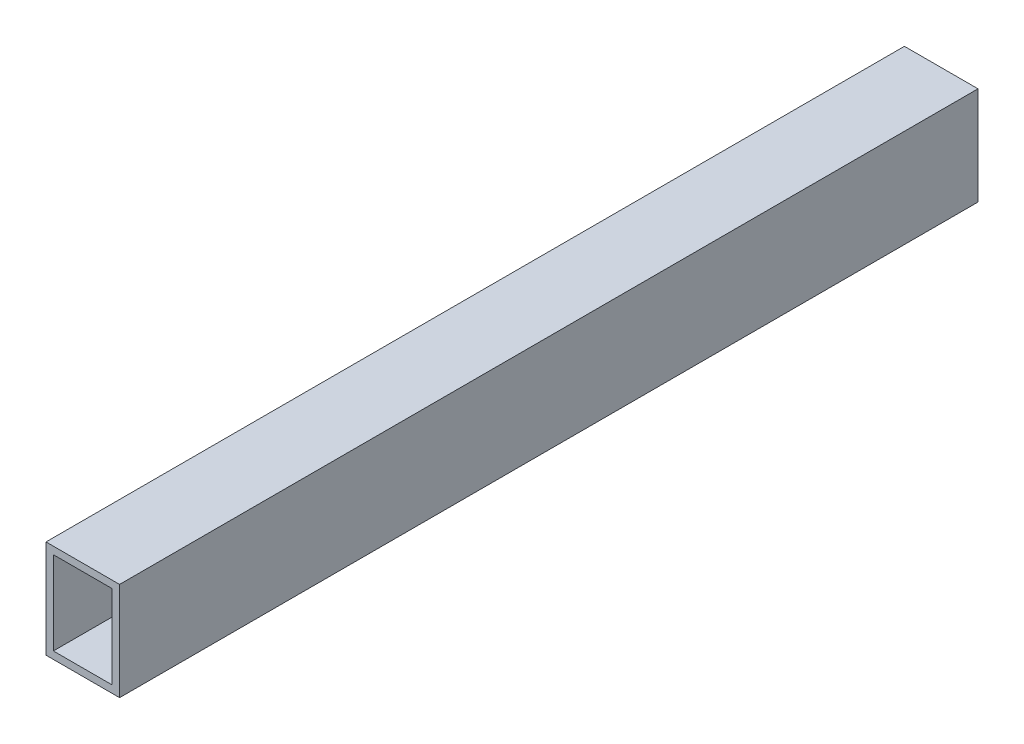
ISO-10303-21;
HEADER;
FILE_DESCRIPTION(('STEP AP214'),'2;1');
FILE_NAME('part.step','',(''),(''),'','','');
FILE_SCHEMA(('AUTOMOTIVE_DESIGN { 1 0 10303 214 1 1 1 1 }'));
ENDSEC;
DATA;
#1=APPLICATION_CONTEXT('core data for automotive mechanical design processes');
#2=APPLICATION_PROTOCOL_DEFINITION('international standard','automotive_design',2000,#1);
#3=PRODUCT_CONTEXT('',#1,'mechanical');
#4=PRODUCT('Part','Part','',(#3));
#5=PRODUCT_RELATED_PRODUCT_CATEGORY('part','',(#4));
#6=PRODUCT_DEFINITION_FORMATION('','',#4);
#7=PRODUCT_DEFINITION_CONTEXT('part definition',#1,'design');
#8=PRODUCT_DEFINITION('design','',#6,#7);
#9=PRODUCT_DEFINITION_SHAPE('','',#8);
#10=(LENGTH_UNIT() NAMED_UNIT(*) SI_UNIT(.MILLI.,.METRE.));
#11=(NAMED_UNIT(*) PLANE_ANGLE_UNIT() SI_UNIT($,.RADIAN.));
#12=(NAMED_UNIT(*) SI_UNIT($,.STERADIAN.) SOLID_ANGLE_UNIT());
#13=UNCERTAINTY_MEASURE_WITH_UNIT(LENGTH_MEASURE(1.E-05),#10,'distance_accuracy_value','');
#14=(GEOMETRIC_REPRESENTATION_CONTEXT(3) GLOBAL_UNCERTAINTY_ASSIGNED_CONTEXT((#13)) GLOBAL_UNIT_ASSIGNED_CONTEXT((#10,
#11,#12)) REPRESENTATION_CONTEXT('',''));
#15=CARTESIAN_POINT('',(0.,0.,0.));
#16=DIRECTION('',(0.,0.,1.));
#17=DIRECTION('',(1.,0.,0.));
#18=AXIS2_PLACEMENT_3D('',#15,#16,#17);
#19=CARTESIAN_POINT('',(30.,-20.,175.));
#20=DIRECTION('',(0.,1.,0.));
#21=DIRECTION('',(0.,0.,1.));
#22=AXIS2_PLACEMENT_3D('',#19,#20,#21);
#23=PLANE('',#22);
#24=DIRECTION('',(0.,0.,-1.));
#25=VECTOR('',#24,1.);
#26=CARTESIAN_POINT('',(0.,-20.,175.));
#27=LINE('',#26,#25);
#28=CARTESIAN_POINT('',(0.,-20.,175.));
#29=VERTEX_POINT('',#28);
#30=CARTESIAN_POINT('',(0.,-20.,-175.));
#31=VERTEX_POINT('',#30);
#32=EDGE_CURVE('E134',#29,#31,#27,.T.);
#33=ORIENTED_EDGE('',*,*,#32,.T.);
#34=DIRECTION('',(-1.,0.,0.));
#35=VECTOR('',#34,1.);
#36=CARTESIAN_POINT('',(30.,-20.,-175.));
#37=LINE('',#36,#35);
#38=CARTESIAN_POINT('',(30.,-20.,-175.));
#39=VERTEX_POINT('',#38);
#40=EDGE_CURVE('E11',#39,#31,#37,.T.);
#41=ORIENTED_EDGE('',*,*,#40,.F.);
#42=DIRECTION('',(0.,0.,-1.));
#43=VECTOR('',#42,1.);
#44=CARTESIAN_POINT('',(30.,-20.,175.));
#45=LINE('',#44,#43);
#46=CARTESIAN_POINT('',(30.,-20.,175.));
#47=VERTEX_POINT('',#46);
#48=EDGE_CURVE('E135',#47,#39,#45,.T.);
#49=ORIENTED_EDGE('',*,*,#48,.F.);
#50=DIRECTION('',(-1.,0.,0.));
#51=VECTOR('',#50,1.);
#52=CARTESIAN_POINT('',(30.,-20.,175.));
#53=LINE('',#52,#51);
#54=EDGE_CURVE('E145',#47,#29,#53,.T.);
#55=ORIENTED_EDGE('',*,*,#54,.T.);
#56=EDGE_LOOP('',(#33,#41,#49,#55));
#57=FACE_BOUND('',#56,.T.);
#58=ADVANCED_FACE('F33',(#57),#23,.F.);
#59=CARTESIAN_POINT('',(30.,-20.,-175.));
#60=DIRECTION('',(0.,0.,1.));
#61=DIRECTION('',(1.,0.,0.));
#62=AXIS2_PLACEMENT_3D('',#59,#60,#61);
#63=PLANE('',#62);
#64=DIRECTION('',(-1.,0.,0.));
#65=VECTOR('',#64,1.);
#66=CARTESIAN_POINT('',(30.,17.,-175.));
#67=LINE('',#66,#65);
#68=CARTESIAN_POINT('',(27.,17.,-175.));
#69=VERTEX_POINT('',#68);
#70=CARTESIAN_POINT('',(2.99999999999999,17.,-175.));
#71=VERTEX_POINT('',#70);
#72=EDGE_CURVE('E128',#69,#71,#67,.T.);
#73=ORIENTED_EDGE('',*,*,#72,.T.);
#74=DIRECTION('',(0.,-1.,0.));
#75=VECTOR('',#74,1.);
#76=CARTESIAN_POINT('',(3.,-20.,-175.));
#77=LINE('',#76,#75);
#78=CARTESIAN_POINT('',(3.,-17.,-175.));
#79=VERTEX_POINT('',#78);
#80=EDGE_CURVE('E131',#71,#79,#77,.T.);
#81=ORIENTED_EDGE('',*,*,#80,.T.);
#82=DIRECTION('',(1.,0.,0.));
#83=VECTOR('',#82,1.);
#84=CARTESIAN_POINT('',(30.,-17.,-175.));
#85=LINE('',#84,#83);
#86=CARTESIAN_POINT('',(27.,-17.,-175.));
#87=VERTEX_POINT('',#86);
#88=EDGE_CURVE('E123',#79,#87,#85,.T.);
#89=ORIENTED_EDGE('',*,*,#88,.T.);
#90=DIRECTION('',(0.,1.,0.));
#91=VECTOR('',#90,1.);
#92=CARTESIAN_POINT('',(27.,-20.,-175.));
#93=LINE('',#92,#91);
#94=EDGE_CURVE('E103',#87,#69,#93,.T.);
#95=ORIENTED_EDGE('',*,*,#94,.T.);
#96=EDGE_LOOP('',(#73,#81,#89,#95));
#97=FACE_BOUND('',#96,.T.);
#98=DIRECTION('',(0.,1.,0.));
#99=VECTOR('',#98,1.);
#100=CARTESIAN_POINT('',(0.,-20.,-175.));
#101=LINE('',#100,#99);
#102=CARTESIAN_POINT('',(0.,20.,-175.));
#103=VERTEX_POINT('',#102);
#104=EDGE_CURVE('E148',#31,#103,#101,.T.);
#105=ORIENTED_EDGE('',*,*,#104,.T.);
#106=DIRECTION('',(-1.,0.,0.));
#107=VECTOR('',#106,1.);
#108=CARTESIAN_POINT('',(30.,20.,-175.));
#109=LINE('',#108,#107);
#110=CARTESIAN_POINT('',(30.,20.,-175.));
#111=VERTEX_POINT('',#110);
#112=EDGE_CURVE('E40',#111,#103,#109,.T.);
#113=ORIENTED_EDGE('',*,*,#112,.F.);
#114=DIRECTION('',(0.,1.,0.));
#115=VECTOR('',#114,1.);
#116=CARTESIAN_POINT('',(30.,-20.,-175.));
#117=LINE('',#116,#115);
#118=EDGE_CURVE('E138',#39,#111,#117,.T.);
#119=ORIENTED_EDGE('',*,*,#118,.F.);
#120=ORIENTED_EDGE('',*,*,#40,.T.);
#121=EDGE_LOOP('',(#105,#113,#119,#120));
#122=FACE_BOUND('',#121,.T.);
#123=ADVANCED_FACE('F176',(#97,#122),#63,.F.);
#124=CARTESIAN_POINT('',(30.,20.,175.));
#125=DIRECTION('',(0.,-1.,0.));
#126=DIRECTION('',(0.,0.,-1.));
#127=AXIS2_PLACEMENT_3D('',#124,#125,#126);
#128=PLANE('',#127);
#129=DIRECTION('',(0.,0.,1.));
#130=VECTOR('',#129,1.);
#131=CARTESIAN_POINT('',(0.,20.,175.));
#132=LINE('',#131,#130);
#133=CARTESIAN_POINT('',(0.,20.,175.));
#134=VERTEX_POINT('',#133);
#135=EDGE_CURVE('E150',#103,#134,#132,.T.);
#136=ORIENTED_EDGE('',*,*,#135,.T.);
#137=DIRECTION('',(-1.,0.,0.));
#138=VECTOR('',#137,1.);
#139=CARTESIAN_POINT('',(30.,20.,175.));
#140=LINE('',#139,#138);
#141=CARTESIAN_POINT('',(30.,20.,175.));
#142=VERTEX_POINT('',#141);
#143=EDGE_CURVE('E155',#142,#134,#140,.T.);
#144=ORIENTED_EDGE('',*,*,#143,.F.);
#145=DIRECTION('',(0.,0.,1.));
#146=VECTOR('',#145,1.);
#147=CARTESIAN_POINT('',(30.,20.,175.));
#148=LINE('',#147,#146);
#149=EDGE_CURVE('E141',#111,#142,#148,.T.);
#150=ORIENTED_EDGE('',*,*,#149,.F.);
#151=ORIENTED_EDGE('',*,*,#112,.T.);
#152=EDGE_LOOP('',(#136,#144,#150,#151));
#153=FACE_BOUND('',#152,.T.);
#154=ADVANCED_FACE('F162',(#153),#128,.F.);
#155=CARTESIAN_POINT('',(30.,-20.,175.));
#156=DIRECTION('',(0.,0.,-1.));
#157=DIRECTION('',(-1.,0.,0.));
#158=AXIS2_PLACEMENT_3D('',#155,#156,#157);
#159=PLANE('',#158);
#160=DIRECTION('',(1.,0.,0.));
#161=VECTOR('',#160,1.);
#162=CARTESIAN_POINT('',(3.,-17.,175.));
#163=LINE('',#162,#161);
#164=CARTESIAN_POINT('',(3.,-17.,175.));
#165=VERTEX_POINT('',#164);
#166=CARTESIAN_POINT('',(27.,-17.,175.));
#167=VERTEX_POINT('',#166);
#168=EDGE_CURVE('E109',#165,#167,#163,.T.);
#169=ORIENTED_EDGE('',*,*,#168,.F.);
#170=DIRECTION('',(0.,-1.,0.));
#171=VECTOR('',#170,1.);
#172=CARTESIAN_POINT('',(3.,-17.,175.));
#173=LINE('',#172,#171);
#174=CARTESIAN_POINT('',(2.99999999999999,17.,175.));
#175=VERTEX_POINT('',#174);
#176=EDGE_CURVE('E55',#175,#165,#173,.T.);
#177=ORIENTED_EDGE('',*,*,#176,.F.);
#178=DIRECTION('',(-1.,0.,0.));
#179=VECTOR('',#178,1.);
#180=CARTESIAN_POINT('',(2.99999999999999,17.,175.));
#181=LINE('',#180,#179);
#182=CARTESIAN_POINT('',(27.,17.,175.));
#183=VERTEX_POINT('',#182);
#184=EDGE_CURVE('E116',#183,#175,#181,.T.);
#185=ORIENTED_EDGE('',*,*,#184,.F.);
#186=DIRECTION('',(0.,1.,0.));
#187=VECTOR('',#186,1.);
#188=CARTESIAN_POINT('',(27.,-17.,175.));
#189=LINE('',#188,#187);
#190=EDGE_CURVE('E100',#167,#183,#189,.T.);
#191=ORIENTED_EDGE('',*,*,#190,.F.);
#192=EDGE_LOOP('',(#169,#177,#185,#191));
#193=FACE_BOUND('',#192,.T.);
#194=DIRECTION('',(0.,-1.,0.));
#195=VECTOR('',#194,1.);
#196=CARTESIAN_POINT('',(0.,-20.,175.));
#197=LINE('',#196,#195);
#198=EDGE_CURVE('E139',#134,#29,#197,.T.);
#199=ORIENTED_EDGE('',*,*,#198,.T.);
#200=ORIENTED_EDGE('',*,*,#54,.F.);
#201=DIRECTION('',(0.,-1.,0.));
#202=VECTOR('',#201,1.);
#203=CARTESIAN_POINT('',(30.,-20.,175.));
#204=LINE('',#203,#202);
#205=EDGE_CURVE('E143',#142,#47,#204,.T.);
#206=ORIENTED_EDGE('',*,*,#205,.F.);
#207=ORIENTED_EDGE('',*,*,#143,.T.);
#208=EDGE_LOOP('',(#199,#200,#206,#207));
#209=FACE_BOUND('',#208,.T.);
#210=ADVANCED_FACE('F113',(#193,#209),#159,.F.);
#211=CARTESIAN_POINT('',(30.,0.,0.));
#212=DIRECTION('',(1.,0.,0.));
#213=DIRECTION('',(0.,0.,-1.));
#214=AXIS2_PLACEMENT_3D('',#211,#212,#213);
#215=PLANE('',#214);
#216=ORIENTED_EDGE('',*,*,#48,.T.);
#217=ORIENTED_EDGE('',*,*,#118,.T.);
#218=ORIENTED_EDGE('',*,*,#149,.T.);
#219=ORIENTED_EDGE('',*,*,#205,.T.);
#220=EDGE_LOOP('',(#216,#217,#218,#219));
#221=FACE_BOUND('',#220,.T.);
#222=ADVANCED_FACE('F175',(#221),#215,.T.);
#223=CARTESIAN_POINT('',(0.,0.,0.));
#224=DIRECTION('',(1.,0.,0.));
#225=DIRECTION('',(0.,0.,-1.));
#226=AXIS2_PLACEMENT_3D('',#223,#224,#225);
#227=PLANE('',#226);
#228=ORIENTED_EDGE('',*,*,#32,.F.);
#229=ORIENTED_EDGE('',*,*,#198,.F.);
#230=ORIENTED_EDGE('',*,*,#135,.F.);
#231=ORIENTED_EDGE('',*,*,#104,.F.);
#232=EDGE_LOOP('',(#228,#229,#230,#231));
#233=FACE_BOUND('',#232,.T.);
#234=ADVANCED_FACE('F168',(#233),#227,.F.);
#235=CARTESIAN_POINT('',(3.,-17.,-715.000000000001));
#236=DIRECTION('',(-1.,0.,0.));
#237=DIRECTION('',(0.,-1.,0.));
#238=AXIS2_PLACEMENT_3D('',#235,#236,#237);
#239=PLANE('',#238);
#240=DIRECTION('',(0.,0.,1.));
#241=VECTOR('',#240,1.);
#242=CARTESIAN_POINT('',(2.99999999999999,17.,-715.000000000001));
#243=LINE('',#242,#241);
#244=EDGE_CURVE('E121',#71,#175,#243,.T.);
#245=ORIENTED_EDGE('',*,*,#244,.T.);
#246=ORIENTED_EDGE('',*,*,#176,.T.);
#247=DIRECTION('',(0.,0.,1.));
#248=VECTOR('',#247,1.);
#249=CARTESIAN_POINT('',(3.,-17.,-715.000000000001));
#250=LINE('',#249,#248);
#251=EDGE_CURVE('E106',#79,#165,#250,.T.);
#252=ORIENTED_EDGE('',*,*,#251,.F.);
#253=ORIENTED_EDGE('',*,*,#80,.F.);
#254=EDGE_LOOP('',(#245,#246,#252,#253));
#255=FACE_BOUND('',#254,.T.);
#256=ADVANCED_FACE('F189',(#255),#239,.F.);
#257=CARTESIAN_POINT('',(2.99999999999999,17.,-715.000000000001));
#258=DIRECTION('',(0.,1.,0.));
#259=DIRECTION('',(0.,0.,1.));
#260=AXIS2_PLACEMENT_3D('',#257,#258,#259);
#261=PLANE('',#260);
#262=DIRECTION('',(0.,0.,1.));
#263=VECTOR('',#262,1.);
#264=CARTESIAN_POINT('',(27.,17.,-715.000000000001));
#265=LINE('',#264,#263);
#266=EDGE_CURVE('E105',#69,#183,#265,.T.);
#267=ORIENTED_EDGE('',*,*,#266,.T.);
#268=ORIENTED_EDGE('',*,*,#184,.T.);
#269=ORIENTED_EDGE('',*,*,#244,.F.);
#270=ORIENTED_EDGE('',*,*,#72,.F.);
#271=EDGE_LOOP('',(#267,#268,#269,#270));
#272=FACE_BOUND('',#271,.T.);
#273=ADVANCED_FACE('F194',(#272),#261,.F.);
#274=CARTESIAN_POINT('',(27.,-17.,-715.000000000001));
#275=DIRECTION('',(1.,0.,0.));
#276=DIRECTION('',(0.,1.,0.));
#277=AXIS2_PLACEMENT_3D('',#274,#275,#276);
#278=PLANE('',#277);
#279=DIRECTION('',(0.,0.,1.));
#280=VECTOR('',#279,1.);
#281=CARTESIAN_POINT('',(27.,-17.,-715.000000000001));
#282=LINE('',#281,#280);
#283=EDGE_CURVE('E47',#87,#167,#282,.T.);
#284=ORIENTED_EDGE('',*,*,#283,.T.);
#285=ORIENTED_EDGE('',*,*,#190,.T.);
#286=ORIENTED_EDGE('',*,*,#266,.F.);
#287=ORIENTED_EDGE('',*,*,#94,.F.);
#288=EDGE_LOOP('',(#284,#285,#286,#287));
#289=FACE_BOUND('',#288,.T.);
#290=ADVANCED_FACE('F97',(#289),#278,.F.);
#291=CARTESIAN_POINT('',(3.,-17.,-715.000000000001));
#292=DIRECTION('',(0.,-1.,0.));
#293=DIRECTION('',(0.,0.,-1.));
#294=AXIS2_PLACEMENT_3D('',#291,#292,#293);
#295=PLANE('',#294);
#296=ORIENTED_EDGE('',*,*,#251,.T.);
#297=ORIENTED_EDGE('',*,*,#168,.T.);
#298=ORIENTED_EDGE('',*,*,#283,.F.);
#299=ORIENTED_EDGE('',*,*,#88,.F.);
#300=EDGE_LOOP('',(#296,#297,#298,#299));
#301=FACE_BOUND('',#300,.T.);
#302=ADVANCED_FACE('F110',(#301),#295,.F.);
#303=CLOSED_SHELL('',(#58,#123,#154,#210,#222,#234,#256,#273,#290,#302));
#304=MANIFOLD_SOLID_BREP('B2',#303);
#305=ADVANCED_BREP_SHAPE_REPRESENTATION('',(#18,#304),#14);
#306=SHAPE_DEFINITION_REPRESENTATION(#9,#305);
ENDSEC;
END-ISO-10303-21;
